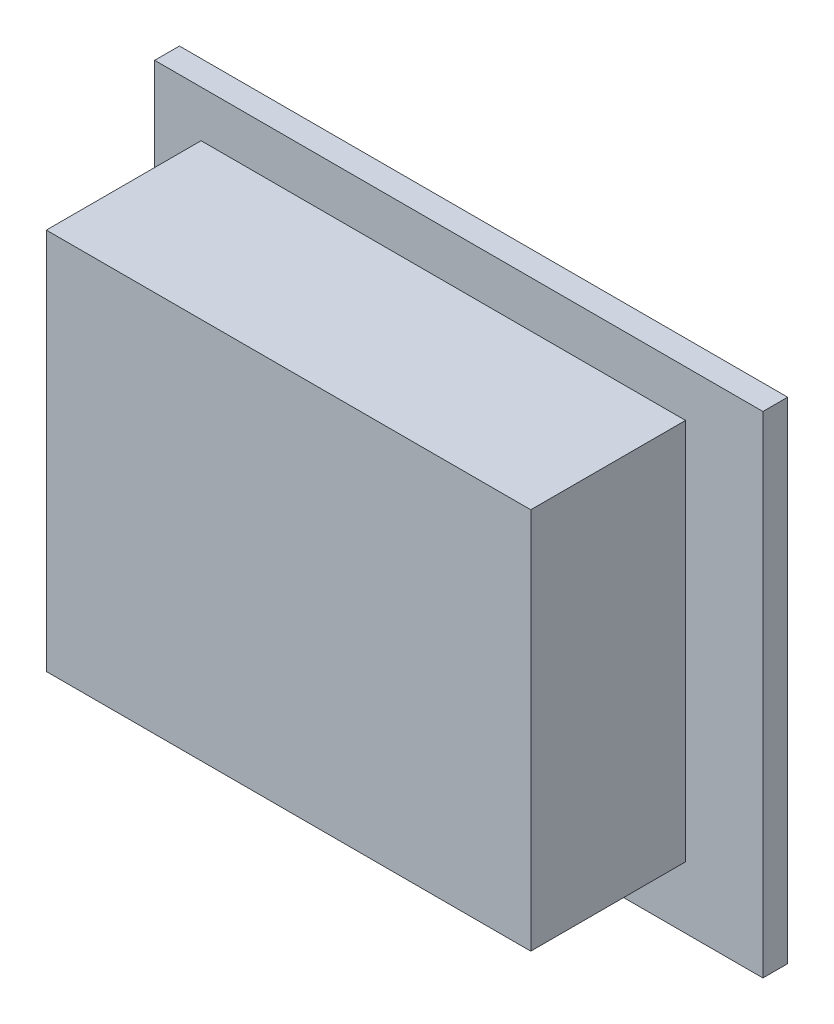
ISO-10303-21;
HEADER;
FILE_DESCRIPTION(('STEP AP214'),'2;1');
FILE_NAME('part.step','',(''),(''),'','','');
FILE_SCHEMA(('AUTOMOTIVE_DESIGN { 1 0 10303 214 1 1 1 1 }'));
ENDSEC;
DATA;
#1=APPLICATION_CONTEXT('core data for automotive mechanical design processes');
#2=APPLICATION_PROTOCOL_DEFINITION('international standard','automotive_design',2000,#1);
#3=PRODUCT_CONTEXT('',#1,'mechanical');
#4=PRODUCT('Part','Part','',(#3));
#5=PRODUCT_RELATED_PRODUCT_CATEGORY('part','',(#4));
#6=PRODUCT_DEFINITION_FORMATION('','',#4);
#7=PRODUCT_DEFINITION_CONTEXT('part definition',#1,'design');
#8=PRODUCT_DEFINITION('design','',#6,#7);
#9=PRODUCT_DEFINITION_SHAPE('','',#8);
#10=(LENGTH_UNIT() NAMED_UNIT(*) SI_UNIT(.MILLI.,.METRE.));
#11=(NAMED_UNIT(*) PLANE_ANGLE_UNIT() SI_UNIT($,.RADIAN.));
#12=(NAMED_UNIT(*) SI_UNIT($,.STERADIAN.) SOLID_ANGLE_UNIT());
#13=UNCERTAINTY_MEASURE_WITH_UNIT(LENGTH_MEASURE(1.E-05),#10,'distance_accuracy_value','');
#14=(GEOMETRIC_REPRESENTATION_CONTEXT(3) GLOBAL_UNCERTAINTY_ASSIGNED_CONTEXT((#13)) GLOBAL_UNIT_ASSIGNED_CONTEXT((#10,
#11,#12)) REPRESENTATION_CONTEXT('',''));
#15=CARTESIAN_POINT('',(0.,0.,0.));
#16=DIRECTION('',(0.,0.,1.));
#17=DIRECTION('',(1.,0.,0.));
#18=AXIS2_PLACEMENT_3D('',#15,#16,#17);
#19=CARTESIAN_POINT('',(0.,0.,1.6));
#20=DIRECTION('',(0.,0.,-1.));
#21=DIRECTION('',(-1.,0.,0.));
#22=AXIS2_PLACEMENT_3D('',#19,#20,#21);
#23=PLANE('',#22);
#24=DIRECTION('',(0.,-1.,0.));
#25=VECTOR('',#24,1.);
#26=CARTESIAN_POINT('',(0.,0.,1.6));
#27=LINE('',#26,#25);
#28=CARTESIAN_POINT('',(0.,31.7,1.6));
#29=VERTEX_POINT('',#28);
#30=CARTESIAN_POINT('',(0.,0.,1.6));
#31=VERTEX_POINT('',#30);
#32=EDGE_CURVE('E128',#29,#31,#27,.T.);
#33=ORIENTED_EDGE('',*,*,#32,.T.);
#34=DIRECTION('',(1.,0.,0.));
#35=VECTOR('',#34,1.);
#36=CARTESIAN_POINT('',(0.,0.,1.6));
#37=LINE('',#36,#35);
#38=CARTESIAN_POINT('',(39.3,0.,1.6));
#39=VERTEX_POINT('',#38);
#40=EDGE_CURVE('E131',#31,#39,#37,.T.);
#41=ORIENTED_EDGE('',*,*,#40,.T.);
#42=DIRECTION('',(0.,1.,0.));
#43=VECTOR('',#42,1.);
#44=CARTESIAN_POINT('',(39.3,0.,1.6));
#45=LINE('',#44,#43);
#46=CARTESIAN_POINT('',(39.3,31.7,1.6));
#47=VERTEX_POINT('',#46);
#48=EDGE_CURVE('E134',#39,#47,#45,.T.);
#49=ORIENTED_EDGE('',*,*,#48,.T.);
#50=DIRECTION('',(-1.,0.,0.));
#51=VECTOR('',#50,1.);
#52=CARTESIAN_POINT('',(0.,31.7,1.6));
#53=LINE('',#52,#51);
#54=EDGE_CURVE('E136',#47,#29,#53,.T.);
#55=ORIENTED_EDGE('',*,*,#54,.T.);
#56=EDGE_LOOP('',(#33,#41,#49,#55));
#57=FACE_BOUND('',#56,.T.);
#58=DIRECTION('',(0.,-1.,0.));
#59=VECTOR('',#58,1.);
#60=CARTESIAN_POINT('',(3.,4.,1.6));
#61=LINE('',#60,#59);
#62=CARTESIAN_POINT('',(3.,28.7,1.6));
#63=VERTEX_POINT('',#62);
#64=CARTESIAN_POINT('',(3.,4.,1.6));
#65=VERTEX_POINT('',#64);
#66=EDGE_CURVE('E118',#63,#65,#61,.T.);
#67=ORIENTED_EDGE('',*,*,#66,.F.);
#68=DIRECTION('',(-1.,0.,0.));
#69=VECTOR('',#68,1.);
#70=CARTESIAN_POINT('',(3.,28.7,1.6));
#71=LINE('',#70,#69);
#72=CARTESIAN_POINT('',(34.3,28.7,1.6));
#73=VERTEX_POINT('',#72);
#74=EDGE_CURVE('E115',#73,#63,#71,.T.);
#75=ORIENTED_EDGE('',*,*,#74,.F.);
#76=DIRECTION('',(0.,1.,0.));
#77=VECTOR('',#76,1.);
#78=CARTESIAN_POINT('',(34.3,4.,1.6));
#79=LINE('',#78,#77);
#80=CARTESIAN_POINT('',(34.3,4.,1.6));
#81=VERTEX_POINT('',#80);
#82=EDGE_CURVE('E53',#81,#73,#79,.T.);
#83=ORIENTED_EDGE('',*,*,#82,.F.);
#84=DIRECTION('',(1.,0.,0.));
#85=VECTOR('',#84,1.);
#86=CARTESIAN_POINT('',(3.,4.,1.6));
#87=LINE('',#86,#85);
#88=EDGE_CURVE('E48',#65,#81,#87,.T.);
#89=ORIENTED_EDGE('',*,*,#88,.F.);
#90=EDGE_LOOP('',(#67,#75,#83,#89));
#91=FACE_BOUND('',#90,.T.);
#92=ADVANCED_FACE('F33',(#57,#91),#23,.F.);
#93=CARTESIAN_POINT('',(0.,0.,1.6));
#94=DIRECTION('',(1.,0.,0.));
#95=DIRECTION('',(0.,0.,-1.));
#96=AXIS2_PLACEMENT_3D('',#93,#94,#95);
#97=PLANE('',#96);
#98=DIRECTION('',(0.,-1.,0.));
#99=VECTOR('',#98,1.);
#100=CARTESIAN_POINT('',(0.,0.,0.));
#101=LINE('',#100,#99);
#102=CARTESIAN_POINT('',(0.,31.7,0.));
#103=VERTEX_POINT('',#102);
#104=CARTESIAN_POINT('',(0.,0.,0.));
#105=VERTEX_POINT('',#104);
#106=EDGE_CURVE('E119',#103,#105,#101,.T.);
#107=ORIENTED_EDGE('',*,*,#106,.T.);
#108=DIRECTION('',(0.,0.,-1.));
#109=VECTOR('',#108,1.);
#110=CARTESIAN_POINT('',(0.,0.,1.6));
#111=LINE('',#110,#109);
#112=EDGE_CURVE('E11',#31,#105,#111,.T.);
#113=ORIENTED_EDGE('',*,*,#112,.F.);
#114=ORIENTED_EDGE('',*,*,#32,.F.);
#115=DIRECTION('',(0.,0.,-1.));
#116=VECTOR('',#115,1.);
#117=CARTESIAN_POINT('',(0.,31.7,1.6));
#118=LINE('',#117,#116);
#119=EDGE_CURVE('E137',#29,#103,#118,.T.);
#120=ORIENTED_EDGE('',*,*,#119,.T.);
#121=EDGE_LOOP('',(#107,#113,#114,#120));
#122=FACE_BOUND('',#121,.T.);
#123=ADVANCED_FACE('F35',(#122),#97,.F.);
#124=CARTESIAN_POINT('',(0.,0.,1.6));
#125=DIRECTION('',(0.,1.,0.));
#126=DIRECTION('',(0.,0.,1.));
#127=AXIS2_PLACEMENT_3D('',#124,#125,#126);
#128=PLANE('',#127);
#129=DIRECTION('',(1.,0.,0.));
#130=VECTOR('',#129,1.);
#131=CARTESIAN_POINT('',(0.,0.,0.));
#132=LINE('',#131,#130);
#133=CARTESIAN_POINT('',(39.3,0.,0.));
#134=VERTEX_POINT('',#133);
#135=EDGE_CURVE('E122',#105,#134,#132,.T.);
#136=ORIENTED_EDGE('',*,*,#135,.T.);
#137=DIRECTION('',(0.,0.,-1.));
#138=VECTOR('',#137,1.);
#139=CARTESIAN_POINT('',(39.3,0.,1.6));
#140=LINE('',#139,#138);
#141=EDGE_CURVE('E41',#39,#134,#140,.T.);
#142=ORIENTED_EDGE('',*,*,#141,.F.);
#143=ORIENTED_EDGE('',*,*,#40,.F.);
#144=ORIENTED_EDGE('',*,*,#112,.T.);
#145=EDGE_LOOP('',(#136,#142,#143,#144));
#146=FACE_BOUND('',#145,.T.);
#147=ADVANCED_FACE('F167',(#146),#128,.F.);
#148=CARTESIAN_POINT('',(39.3,0.,1.6));
#149=DIRECTION('',(-1.,0.,0.));
#150=DIRECTION('',(0.,0.,1.));
#151=AXIS2_PLACEMENT_3D('',#148,#149,#150);
#152=PLANE('',#151);
#153=DIRECTION('',(0.,1.,0.));
#154=VECTOR('',#153,1.);
#155=CARTESIAN_POINT('',(39.3,0.,0.));
#156=LINE('',#155,#154);
#157=CARTESIAN_POINT('',(39.3,31.7,0.));
#158=VERTEX_POINT('',#157);
#159=EDGE_CURVE('E140',#134,#158,#156,.T.);
#160=ORIENTED_EDGE('',*,*,#159,.T.);
#161=DIRECTION('',(0.,0.,-1.));
#162=VECTOR('',#161,1.);
#163=CARTESIAN_POINT('',(39.3,31.7,1.6));
#164=LINE('',#163,#162);
#165=EDGE_CURVE('E145',#47,#158,#164,.T.);
#166=ORIENTED_EDGE('',*,*,#165,.F.);
#167=ORIENTED_EDGE('',*,*,#48,.F.);
#168=ORIENTED_EDGE('',*,*,#141,.T.);
#169=EDGE_LOOP('',(#160,#166,#167,#168));
#170=FACE_BOUND('',#169,.T.);
#171=ADVANCED_FACE('F152',(#170),#152,.F.);
#172=CARTESIAN_POINT('',(0.,31.7,1.6));
#173=DIRECTION('',(0.,-1.,0.));
#174=DIRECTION('',(0.,0.,-1.));
#175=AXIS2_PLACEMENT_3D('',#172,#173,#174);
#176=PLANE('',#175);
#177=DIRECTION('',(-1.,0.,0.));
#178=VECTOR('',#177,1.);
#179=CARTESIAN_POINT('',(0.,31.7,0.));
#180=LINE('',#179,#178);
#181=EDGE_CURVE('E132',#158,#103,#180,.T.);
#182=ORIENTED_EDGE('',*,*,#181,.T.);
#183=ORIENTED_EDGE('',*,*,#119,.F.);
#184=ORIENTED_EDGE('',*,*,#54,.F.);
#185=ORIENTED_EDGE('',*,*,#165,.T.);
#186=EDGE_LOOP('',(#182,#183,#184,#185));
#187=FACE_BOUND('',#186,.T.);
#188=ADVANCED_FACE('F161',(#187),#176,.F.);
#189=CARTESIAN_POINT('',(0.,0.,0.));
#190=DIRECTION('',(0.,0.,-1.));
#191=DIRECTION('',(-1.,0.,0.));
#192=AXIS2_PLACEMENT_3D('',#189,#190,#191);
#193=PLANE('',#192);
#194=ORIENTED_EDGE('',*,*,#106,.F.);
#195=ORIENTED_EDGE('',*,*,#181,.F.);
#196=ORIENTED_EDGE('',*,*,#159,.F.);
#197=ORIENTED_EDGE('',*,*,#135,.F.);
#198=EDGE_LOOP('',(#194,#195,#196,#197));
#199=FACE_BOUND('',#198,.T.);
#200=ADVANCED_FACE('F158',(#199),#193,.T.);
#201=CARTESIAN_POINT('',(3.,4.,11.6));
#202=DIRECTION('',(1.,0.,0.));
#203=DIRECTION('',(0.,0.,-1.));
#204=AXIS2_PLACEMENT_3D('',#201,#202,#203);
#205=PLANE('',#204);
#206=ORIENTED_EDGE('',*,*,#66,.T.);
#207=DIRECTION('',(0.,0.,-1.));
#208=VECTOR('',#207,1.);
#209=CARTESIAN_POINT('',(3.,4.,11.6));
#210=LINE('',#209,#208);
#211=CARTESIAN_POINT('',(3.,4.,11.6));
#212=VERTEX_POINT('',#211);
#213=EDGE_CURVE('E99',#212,#65,#210,.T.);
#214=ORIENTED_EDGE('',*,*,#213,.F.);
#215=DIRECTION('',(0.,-1.,0.));
#216=VECTOR('',#215,1.);
#217=CARTESIAN_POINT('',(3.,4.,11.6));
#218=LINE('',#217,#216);
#219=CARTESIAN_POINT('',(3.,28.7,11.6));
#220=VERTEX_POINT('',#219);
#221=EDGE_CURVE('E106',#220,#212,#218,.T.);
#222=ORIENTED_EDGE('',*,*,#221,.F.);
#223=DIRECTION('',(0.,0.,-1.));
#224=VECTOR('',#223,1.);
#225=CARTESIAN_POINT('',(3.,28.7,11.6));
#226=LINE('',#225,#224);
#227=EDGE_CURVE('E260',#220,#63,#226,.T.);
#228=ORIENTED_EDGE('',*,*,#227,.T.);
#229=EDGE_LOOP('',(#206,#214,#222,#228));
#230=FACE_BOUND('',#229,.T.);
#231=ADVANCED_FACE('F117',(#230),#205,.F.);
#232=CARTESIAN_POINT('',(3.,4.,11.6));
#233=DIRECTION('',(0.,1.,0.));
#234=DIRECTION('',(-1.,0.,0.));
#235=AXIS2_PLACEMENT_3D('',#232,#233,#234);
#236=PLANE('',#235);
#237=ORIENTED_EDGE('',*,*,#88,.T.);
#238=DIRECTION('',(0.,0.,-1.));
#239=VECTOR('',#238,1.);
#240=CARTESIAN_POINT('',(34.3,4.,11.6));
#241=LINE('',#240,#239);
#242=CARTESIAN_POINT('',(34.3,4.,11.6));
#243=VERTEX_POINT('',#242);
#244=EDGE_CURVE('E102',#243,#81,#241,.T.);
#245=ORIENTED_EDGE('',*,*,#244,.F.);
#246=DIRECTION('',(1.,0.,0.));
#247=VECTOR('',#246,1.);
#248=CARTESIAN_POINT('',(3.,4.,11.6));
#249=LINE('',#248,#247);
#250=EDGE_CURVE('E95',#212,#243,#249,.T.);
#251=ORIENTED_EDGE('',*,*,#250,.F.);
#252=ORIENTED_EDGE('',*,*,#213,.T.);
#253=EDGE_LOOP('',(#237,#245,#251,#252));
#254=FACE_BOUND('',#253,.T.);
#255=ADVANCED_FACE('F97',(#254),#236,.F.);
#256=CARTESIAN_POINT('',(34.3,4.,11.6));
#257=DIRECTION('',(-1.,0.,0.));
#258=DIRECTION('',(0.,0.,1.));
#259=AXIS2_PLACEMENT_3D('',#256,#257,#258);
#260=PLANE('',#259);
#261=ORIENTED_EDGE('',*,*,#82,.T.);
#262=DIRECTION('',(0.,0.,-1.));
#263=VECTOR('',#262,1.);
#264=CARTESIAN_POINT('',(34.3,28.7,11.6));
#265=LINE('',#264,#263);
#266=CARTESIAN_POINT('',(34.3,28.7,11.6));
#267=VERTEX_POINT('',#266);
#268=EDGE_CURVE('E124',#267,#73,#265,.T.);
#269=ORIENTED_EDGE('',*,*,#268,.F.);
#270=DIRECTION('',(0.,1.,0.));
#271=VECTOR('',#270,1.);
#272=CARTESIAN_POINT('',(34.3,4.,11.6));
#273=LINE('',#272,#271);
#274=EDGE_CURVE('E105',#243,#267,#273,.T.);
#275=ORIENTED_EDGE('',*,*,#274,.F.);
#276=ORIENTED_EDGE('',*,*,#244,.T.);
#277=EDGE_LOOP('',(#261,#269,#275,#276));
#278=FACE_BOUND('',#277,.T.);
#279=ADVANCED_FACE('F203',(#278),#260,.F.);
#280=CARTESIAN_POINT('',(3.,28.7,11.6));
#281=DIRECTION('',(0.,-1.,0.));
#282=DIRECTION('',(0.,0.,-1.));
#283=AXIS2_PLACEMENT_3D('',#280,#281,#282);
#284=PLANE('',#283);
#285=ORIENTED_EDGE('',*,*,#74,.T.);
#286=ORIENTED_EDGE('',*,*,#227,.F.);
#287=DIRECTION('',(-1.,0.,0.));
#288=VECTOR('',#287,1.);
#289=CARTESIAN_POINT('',(3.,28.7,11.6));
#290=LINE('',#289,#288);
#291=EDGE_CURVE('E111',#267,#220,#290,.T.);
#292=ORIENTED_EDGE('',*,*,#291,.F.);
#293=ORIENTED_EDGE('',*,*,#268,.T.);
#294=EDGE_LOOP('',(#285,#286,#292,#293));
#295=FACE_BOUND('',#294,.T.);
#296=ADVANCED_FACE('F209',(#295),#284,.F.);
#297=CARTESIAN_POINT('',(0.,0.,11.6));
#298=DIRECTION('',(0.,0.,-1.));
#299=DIRECTION('',(-1.,0.,0.));
#300=AXIS2_PLACEMENT_3D('',#297,#298,#299);
#301=PLANE('',#300);
#302=ORIENTED_EDGE('',*,*,#221,.T.);
#303=ORIENTED_EDGE('',*,*,#250,.T.);
#304=ORIENTED_EDGE('',*,*,#274,.T.);
#305=ORIENTED_EDGE('',*,*,#291,.T.);
#306=EDGE_LOOP('',(#302,#303,#304,#305));
#307=FACE_BOUND('',#306,.T.);
#308=ADVANCED_FACE('F109',(#307),#301,.F.);
#309=CLOSED_SHELL('',(#92,#123,#147,#171,#188,#200,#231,#255,#279,#296,#308));
#310=MANIFOLD_SOLID_BREP('B2',#309);
#311=ADVANCED_BREP_SHAPE_REPRESENTATION('',(#18,#310),#14);
#312=SHAPE_DEFINITION_REPRESENTATION(#9,#311);
ENDSEC;
END-ISO-10303-21;
